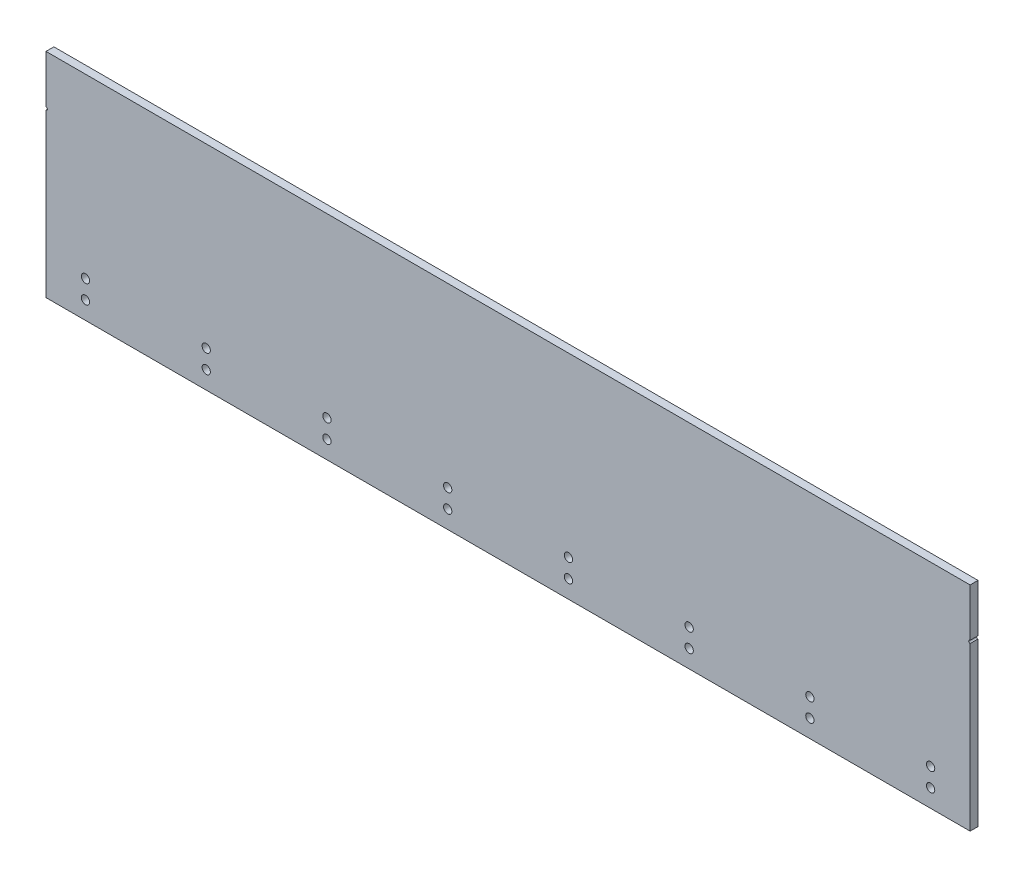
ISO-10303-21;
HEADER;
FILE_DESCRIPTION(('STEP AP214'),'2;1');
FILE_NAME('part.step','',(''),(''),'','','');
FILE_SCHEMA(('AUTOMOTIVE_DESIGN { 1 0 10303 214 1 1 1 1 }'));
ENDSEC;
DATA;
#1=APPLICATION_CONTEXT('core data for automotive mechanical design processes');
#2=APPLICATION_PROTOCOL_DEFINITION('international standard','automotive_design',2000,#1);
#3=PRODUCT_CONTEXT('',#1,'mechanical');
#4=PRODUCT('Part','Part','',(#3));
#5=PRODUCT_RELATED_PRODUCT_CATEGORY('part','',(#4));
#6=PRODUCT_DEFINITION_FORMATION('','',#4);
#7=PRODUCT_DEFINITION_CONTEXT('part definition',#1,'design');
#8=PRODUCT_DEFINITION('design','',#6,#7);
#9=PRODUCT_DEFINITION_SHAPE('','',#8);
#10=(LENGTH_UNIT() NAMED_UNIT(*) SI_UNIT(.MILLI.,.METRE.));
#11=(NAMED_UNIT(*) PLANE_ANGLE_UNIT() SI_UNIT($,.RADIAN.));
#12=(NAMED_UNIT(*) SI_UNIT($,.STERADIAN.) SOLID_ANGLE_UNIT());
#13=UNCERTAINTY_MEASURE_WITH_UNIT(LENGTH_MEASURE(1.E-05),#10,'distance_accuracy_value','');
#14=(GEOMETRIC_REPRESENTATION_CONTEXT(3) GLOBAL_UNCERTAINTY_ASSIGNED_CONTEXT((#13)) GLOBAL_UNIT_ASSIGNED_CONTEXT((#10,
#11,#12)) REPRESENTATION_CONTEXT('',''));
#15=CARTESIAN_POINT('',(0.,0.,0.));
#16=DIRECTION('',(0.,0.,1.));
#17=DIRECTION('',(1.,0.,0.));
#18=AXIS2_PLACEMENT_3D('',#15,#16,#17);
#19=CARTESIAN_POINT('',(0.,0.,-20.));
#20=DIRECTION('',(-1.,0.,0.));
#21=DIRECTION('',(0.,0.,1.));
#22=AXIS2_PLACEMENT_3D('',#19,#20,#21);
#23=PLANE('',#22);
#24=DIRECTION('',(0.,-1.,0.));
#25=VECTOR('',#24,1.);
#26=CARTESIAN_POINT('',(0.,0.,0.));
#27=LINE('',#26,#25);
#28=CARTESIAN_POINT('',(0.,411.5,0.));
#29=VERTEX_POINT('',#28);
#30=CARTESIAN_POINT('',(0.,0.,0.));
#31=VERTEX_POINT('',#30);
#32=EDGE_CURVE('E140',#29,#31,#27,.T.);
#33=ORIENTED_EDGE('',*,*,#32,.F.);
#34=DIRECTION('',(0.,0.,1.));
#35=VECTOR('',#34,1.);
#36=CARTESIAN_POINT('',(0.,411.5,-20.));
#37=LINE('',#36,#35);
#38=CARTESIAN_POINT('',(0.,411.5,-20.));
#39=VERTEX_POINT('',#38);
#40=EDGE_CURVE('E11',#39,#29,#37,.T.);
#41=ORIENTED_EDGE('',*,*,#40,.F.);
#42=DIRECTION('',(0.,-1.,0.));
#43=VECTOR('',#42,1.);
#44=CARTESIAN_POINT('',(0.,0.,-20.));
#45=LINE('',#44,#43);
#46=CARTESIAN_POINT('',(0.,0.,-20.));
#47=VERTEX_POINT('',#46);
#48=EDGE_CURVE('E161',#39,#47,#45,.T.);
#49=ORIENTED_EDGE('',*,*,#48,.T.);
#50=DIRECTION('',(0.,0.,1.));
#51=VECTOR('',#50,1.);
#52=CARTESIAN_POINT('',(0.,0.,-20.));
#53=LINE('',#52,#51);
#54=EDGE_CURVE('E46',#47,#31,#53,.T.);
#55=ORIENTED_EDGE('',*,*,#54,.T.);
#56=EDGE_LOOP('',(#33,#41,#49,#55));
#57=FACE_BOUND('',#56,.T.);
#58=ADVANCED_FACE('F43',(#57),#23,.T.);
#59=CARTESIAN_POINT('',(0.,415.,-20.));
#60=DIRECTION('',(0.,0.,1.));
#61=DIRECTION('',(1.,0.,0.));
#62=AXIS2_PLACEMENT_3D('',#59,#60,#61);
#63=CYLINDRICAL_SURFACE('',#62,3.5);
#64=CARTESIAN_POINT('',(0.,415.,0.));
#65=DIRECTION('',(0.,0.,-1.));
#66=DIRECTION('',(1.,0.,0.));
#67=AXIS2_PLACEMENT_3D('',#64,#65,#66);
#68=CIRCLE('',#67,3.5);
#69=CARTESIAN_POINT('',(0.,418.5,0.));
#70=VERTEX_POINT('',#69);
#71=EDGE_CURVE('E159',#70,#29,#68,.T.);
#72=ORIENTED_EDGE('',*,*,#71,.F.);
#73=DIRECTION('',(0.,0.,1.));
#74=VECTOR('',#73,1.);
#75=CARTESIAN_POINT('',(0.,418.5,-20.));
#76=LINE('',#75,#74);
#77=CARTESIAN_POINT('',(0.,418.5,-20.));
#78=VERTEX_POINT('',#77);
#79=EDGE_CURVE('E52',#78,#70,#76,.T.);
#80=ORIENTED_EDGE('',*,*,#79,.F.);
#81=CARTESIAN_POINT('',(0.,415.,-20.));
#82=DIRECTION('',(0.,0.,-1.));
#83=DIRECTION('',(1.,0.,0.));
#84=AXIS2_PLACEMENT_3D('',#81,#82,#83);
#85=CIRCLE('',#84,3.5);
#86=EDGE_CURVE('E130',#78,#39,#85,.T.);
#87=ORIENTED_EDGE('',*,*,#86,.T.);
#88=ORIENTED_EDGE('',*,*,#40,.T.);
#89=EDGE_LOOP('',(#72,#80,#87,#88));
#90=FACE_BOUND('',#89,.T.);
#91=ADVANCED_FACE('F173',(#90),#63,.F.);
#92=CARTESIAN_POINT('',(0.,418.5,-20.));
#93=DIRECTION('',(-1.,0.,0.));
#94=DIRECTION('',(0.,0.,1.));
#95=AXIS2_PLACEMENT_3D('',#92,#93,#94);
#96=PLANE('',#95);
#97=DIRECTION('',(0.,-1.,0.));
#98=VECTOR('',#97,1.);
#99=CARTESIAN_POINT('',(0.,418.5,0.));
#100=LINE('',#99,#98);
#101=CARTESIAN_POINT('',(0.,540.,0.));
#102=VERTEX_POINT('',#101);
#103=EDGE_CURVE('E117',#102,#70,#100,.T.);
#104=ORIENTED_EDGE('',*,*,#103,.F.);
#105=DIRECTION('',(0.,0.,1.));
#106=VECTOR('',#105,1.);
#107=CARTESIAN_POINT('',(0.,540.,-20.));
#108=LINE('',#107,#106);
#109=CARTESIAN_POINT('',(0.,540.,-20.));
#110=VERTEX_POINT('',#109);
#111=EDGE_CURVE('E112',#110,#102,#108,.T.);
#112=ORIENTED_EDGE('',*,*,#111,.F.);
#113=DIRECTION('',(0.,-1.,0.));
#114=VECTOR('',#113,1.);
#115=CARTESIAN_POINT('',(0.,418.5,-20.));
#116=LINE('',#115,#114);
#117=EDGE_CURVE('E115',#110,#78,#116,.T.);
#118=ORIENTED_EDGE('',*,*,#117,.T.);
#119=ORIENTED_EDGE('',*,*,#79,.T.);
#120=EDGE_LOOP('',(#104,#112,#118,#119));
#121=FACE_BOUND('',#120,.T.);
#122=ADVANCED_FACE('F114',(#121),#96,.T.);
#123=CARTESIAN_POINT('',(0.,540.,-20.));
#124=DIRECTION('',(0.,1.,0.));
#125=DIRECTION('',(0.,0.,1.));
#126=AXIS2_PLACEMENT_3D('',#123,#124,#125);
#127=PLANE('',#126);
#128=DIRECTION('',(-1.,0.,0.));
#129=VECTOR('',#128,1.);
#130=CARTESIAN_POINT('',(0.,540.,0.));
#131=LINE('',#130,#129);
#132=CARTESIAN_POINT('',(2340.,540.,0.));
#133=VERTEX_POINT('',#132);
#134=EDGE_CURVE('E156',#133,#102,#131,.T.);
#135=ORIENTED_EDGE('',*,*,#134,.F.);
#136=DIRECTION('',(0.,0.,1.));
#137=VECTOR('',#136,1.);
#138=CARTESIAN_POINT('',(2340.,540.,-20.));
#139=LINE('',#138,#137);
#140=CARTESIAN_POINT('',(2340.,540.,-20.));
#141=VERTEX_POINT('',#140);
#142=EDGE_CURVE('E122',#141,#133,#139,.T.);
#143=ORIENTED_EDGE('',*,*,#142,.F.);
#144=DIRECTION('',(-1.,0.,0.));
#145=VECTOR('',#144,1.);
#146=CARTESIAN_POINT('',(0.,540.,-20.));
#147=LINE('',#146,#145);
#148=EDGE_CURVE('E128',#141,#110,#147,.T.);
#149=ORIENTED_EDGE('',*,*,#148,.T.);
#150=ORIENTED_EDGE('',*,*,#111,.T.);
#151=EDGE_LOOP('',(#135,#143,#149,#150));
#152=FACE_BOUND('',#151,.T.);
#153=ADVANCED_FACE('F132',(#152),#127,.T.);
#154=CARTESIAN_POINT('',(2340.,418.5,-20.));
#155=DIRECTION('',(1.,0.,0.));
#156=DIRECTION('',(0.,0.,-1.));
#157=AXIS2_PLACEMENT_3D('',#154,#155,#156);
#158=PLANE('',#157);
#159=DIRECTION('',(0.,1.,0.));
#160=VECTOR('',#159,1.);
#161=CARTESIAN_POINT('',(2340.,418.5,0.));
#162=LINE('',#161,#160);
#163=CARTESIAN_POINT('',(2340.,418.5,0.));
#164=VERTEX_POINT('',#163);
#165=EDGE_CURVE('E153',#164,#133,#162,.T.);
#166=ORIENTED_EDGE('',*,*,#165,.F.);
#167=DIRECTION('',(0.,0.,1.));
#168=VECTOR('',#167,1.);
#169=CARTESIAN_POINT('',(2340.,418.5,-20.));
#170=LINE('',#169,#168);
#171=CARTESIAN_POINT('',(2340.,418.5,-20.));
#172=VERTEX_POINT('',#171);
#173=EDGE_CURVE('E165',#172,#164,#170,.T.);
#174=ORIENTED_EDGE('',*,*,#173,.F.);
#175=DIRECTION('',(0.,1.,0.));
#176=VECTOR('',#175,1.);
#177=CARTESIAN_POINT('',(2340.,418.5,-20.));
#178=LINE('',#177,#176);
#179=EDGE_CURVE('E133',#172,#141,#178,.T.);
#180=ORIENTED_EDGE('',*,*,#179,.T.);
#181=ORIENTED_EDGE('',*,*,#142,.T.);
#182=EDGE_LOOP('',(#166,#174,#180,#181));
#183=FACE_BOUND('',#182,.T.);
#184=ADVANCED_FACE('F186',(#183),#158,.T.);
#185=CARTESIAN_POINT('',(2340.,415.,-20.));
#186=DIRECTION('',(0.,0.,1.));
#187=DIRECTION('',(1.,0.,0.));
#188=AXIS2_PLACEMENT_3D('',#185,#186,#187);
#189=CYLINDRICAL_SURFACE('',#188,3.5);
#190=CARTESIAN_POINT('',(2340.,415.,0.));
#191=DIRECTION('',(0.,0.,-1.));
#192=DIRECTION('',(1.,0.,0.));
#193=AXIS2_PLACEMENT_3D('',#190,#191,#192);
#194=CIRCLE('',#193,3.5);
#195=CARTESIAN_POINT('',(2340.,411.5,0.));
#196=VERTEX_POINT('',#195);
#197=EDGE_CURVE('E150',#196,#164,#194,.T.);
#198=ORIENTED_EDGE('',*,*,#197,.F.);
#199=DIRECTION('',(0.,0.,1.));
#200=VECTOR('',#199,1.);
#201=CARTESIAN_POINT('',(2340.,411.5,-20.));
#202=LINE('',#201,#200);
#203=CARTESIAN_POINT('',(2340.,411.5,-20.));
#204=VERTEX_POINT('',#203);
#205=EDGE_CURVE('E167',#204,#196,#202,.T.);
#206=ORIENTED_EDGE('',*,*,#205,.F.);
#207=CARTESIAN_POINT('',(2340.,415.,-20.));
#208=DIRECTION('',(0.,0.,-1.));
#209=DIRECTION('',(1.,0.,0.));
#210=AXIS2_PLACEMENT_3D('',#207,#208,#209);
#211=CIRCLE('',#210,3.5);
#212=EDGE_CURVE('E135',#204,#172,#211,.T.);
#213=ORIENTED_EDGE('',*,*,#212,.T.);
#214=ORIENTED_EDGE('',*,*,#173,.T.);
#215=EDGE_LOOP('',(#198,#206,#213,#214));
#216=FACE_BOUND('',#215,.T.);
#217=ADVANCED_FACE('F189',(#216),#189,.F.);
#218=CARTESIAN_POINT('',(2340.,0.,-20.));
#219=DIRECTION('',(1.,0.,0.));
#220=DIRECTION('',(0.,0.,-1.));
#221=AXIS2_PLACEMENT_3D('',#218,#219,#220);
#222=PLANE('',#221);
#223=DIRECTION('',(0.,1.,0.));
#224=VECTOR('',#223,1.);
#225=CARTESIAN_POINT('',(2340.,0.,0.));
#226=LINE('',#225,#224);
#227=CARTESIAN_POINT('',(2340.,0.,0.));
#228=VERTEX_POINT('',#227);
#229=EDGE_CURVE('E147',#228,#196,#226,.T.);
#230=ORIENTED_EDGE('',*,*,#229,.F.);
#231=DIRECTION('',(0.,0.,1.));
#232=VECTOR('',#231,1.);
#233=CARTESIAN_POINT('',(2340.,0.,-20.));
#234=LINE('',#233,#232);
#235=CARTESIAN_POINT('',(2340.,0.,-20.));
#236=VERTEX_POINT('',#235);
#237=EDGE_CURVE('E168',#236,#228,#234,.T.);
#238=ORIENTED_EDGE('',*,*,#237,.F.);
#239=DIRECTION('',(0.,1.,0.));
#240=VECTOR('',#239,1.);
#241=CARTESIAN_POINT('',(2340.,0.,-20.));
#242=LINE('',#241,#240);
#243=EDGE_CURVE('E375',#236,#204,#242,.T.);
#244=ORIENTED_EDGE('',*,*,#243,.T.);
#245=ORIENTED_EDGE('',*,*,#205,.T.);
#246=EDGE_LOOP('',(#230,#238,#244,#245));
#247=FACE_BOUND('',#246,.T.);
#248=ADVANCED_FACE('F193',(#247),#222,.T.);
#249=CARTESIAN_POINT('',(0.,0.,-20.));
#250=DIRECTION('',(0.,-1.,0.));
#251=DIRECTION('',(0.,0.,-1.));
#252=AXIS2_PLACEMENT_3D('',#249,#250,#251);
#253=PLANE('',#252);
#254=DIRECTION('',(1.,0.,0.));
#255=VECTOR('',#254,1.);
#256=CARTESIAN_POINT('',(0.,0.,0.));
#257=LINE('',#256,#255);
#258=EDGE_CURVE('E143',#31,#228,#257,.T.);
#259=ORIENTED_EDGE('',*,*,#258,.F.);
#260=ORIENTED_EDGE('',*,*,#54,.F.);
#261=DIRECTION('',(1.,0.,0.));
#262=VECTOR('',#261,1.);
#263=CARTESIAN_POINT('',(0.,0.,-20.));
#264=LINE('',#263,#262);
#265=EDGE_CURVE('E373',#47,#236,#264,.T.);
#266=ORIENTED_EDGE('',*,*,#265,.T.);
#267=ORIENTED_EDGE('',*,*,#237,.T.);
#268=EDGE_LOOP('',(#259,#260,#266,#267));
#269=FACE_BOUND('',#268,.T.);
#270=ADVANCED_FACE('F170',(#269),#253,.T.);
#271=CARTESIAN_POINT('',(0.,415.,-20.));
#272=DIRECTION('',(0.,0.,1.));
#273=DIRECTION('',(1.,0.,0.));
#274=AXIS2_PLACEMENT_3D('',#271,#272,#273);
#275=PLANE('',#274);
#276=CARTESIAN_POINT('',(2240.,45.,-20.));
#277=DIRECTION('',(0.,0.,1.));
#278=DIRECTION('',(1.,0.,0.));
#279=AXIS2_PLACEMENT_3D('',#276,#277,#278);
#280=CIRCLE('',#279,10.5000000000001);
#281=CARTESIAN_POINT('',(2250.5,45.,-20.));
#282=VERTEX_POINT('',#281);
#283=EDGE_CURVE('E276',#282,#282,#280,.T.);
#284=ORIENTED_EDGE('',*,*,#283,.T.);
#285=EDGE_LOOP('',(#284));
#286=FACE_BOUND('',#285,.T.);
#287=CARTESIAN_POINT('',(2240.,92.,-20.));
#288=DIRECTION('',(0.,0.,1.));
#289=DIRECTION('',(1.,0.,0.));
#290=AXIS2_PLACEMENT_3D('',#287,#288,#289);
#291=CIRCLE('',#290,10.5000000000001);
#292=CARTESIAN_POINT('',(2250.5,92.,-20.));
#293=VERTEX_POINT('',#292);
#294=EDGE_CURVE('E284',#293,#293,#291,.T.);
#295=ORIENTED_EDGE('',*,*,#294,.T.);
#296=EDGE_LOOP('',(#295));
#297=FACE_BOUND('',#296,.T.);
#298=CARTESIAN_POINT('',(1934.28571428571,45.,-20.));
#299=DIRECTION('',(0.,0.,1.));
#300=DIRECTION('',(1.,0.,0.));
#301=AXIS2_PLACEMENT_3D('',#298,#299,#300);
#302=CIRCLE('',#301,10.4999999999999);
#303=CARTESIAN_POINT('',(1944.78571428571,45.,-20.));
#304=VERTEX_POINT('',#303);
#305=EDGE_CURVE('E290',#304,#304,#302,.T.);
#306=ORIENTED_EDGE('',*,*,#305,.T.);
#307=EDGE_LOOP('',(#306));
#308=FACE_BOUND('',#307,.T.);
#309=CARTESIAN_POINT('',(1934.28571428571,92.,-20.));
#310=DIRECTION('',(0.,0.,1.));
#311=DIRECTION('',(1.,0.,0.));
#312=AXIS2_PLACEMENT_3D('',#309,#310,#311);
#313=CIRCLE('',#312,10.4999999999999);
#314=CARTESIAN_POINT('',(1944.78571428571,92.,-20.));
#315=VERTEX_POINT('',#314);
#316=EDGE_CURVE('E296',#315,#315,#313,.T.);
#317=ORIENTED_EDGE('',*,*,#316,.T.);
#318=EDGE_LOOP('',(#317));
#319=FACE_BOUND('',#318,.T.);
#320=CARTESIAN_POINT('',(1628.57142857143,45.,-20.));
#321=DIRECTION('',(0.,0.,1.));
#322=DIRECTION('',(1.,0.,0.));
#323=AXIS2_PLACEMENT_3D('',#320,#321,#322);
#324=CIRCLE('',#323,10.4999999999999);
#325=CARTESIAN_POINT('',(1639.07142857143,45.,-20.));
#326=VERTEX_POINT('',#325);
#327=EDGE_CURVE('E302',#326,#326,#324,.T.);
#328=ORIENTED_EDGE('',*,*,#327,.T.);
#329=EDGE_LOOP('',(#328));
#330=FACE_BOUND('',#329,.T.);
#331=CARTESIAN_POINT('',(1628.57142857143,92.,-20.));
#332=DIRECTION('',(0.,0.,1.));
#333=DIRECTION('',(1.,0.,0.));
#334=AXIS2_PLACEMENT_3D('',#331,#332,#333);
#335=CIRCLE('',#334,10.4999999999999);
#336=CARTESIAN_POINT('',(1639.07142857143,92.,-20.));
#337=VERTEX_POINT('',#336);
#338=EDGE_CURVE('E308',#337,#337,#335,.T.);
#339=ORIENTED_EDGE('',*,*,#338,.T.);
#340=EDGE_LOOP('',(#339));
#341=FACE_BOUND('',#340,.T.);
#342=CARTESIAN_POINT('',(1322.85714285714,45.,-20.));
#343=DIRECTION('',(0.,0.,1.));
#344=DIRECTION('',(1.,0.,0.));
#345=AXIS2_PLACEMENT_3D('',#342,#343,#344);
#346=CIRCLE('',#345,10.4999999999999);
#347=CARTESIAN_POINT('',(1333.35714285714,45.,-20.));
#348=VERTEX_POINT('',#347);
#349=EDGE_CURVE('E314',#348,#348,#346,.T.);
#350=ORIENTED_EDGE('',*,*,#349,.T.);
#351=EDGE_LOOP('',(#350));
#352=FACE_BOUND('',#351,.T.);
#353=CARTESIAN_POINT('',(1322.85714285714,92.,-20.));
#354=DIRECTION('',(0.,0.,1.));
#355=DIRECTION('',(1.,0.,0.));
#356=AXIS2_PLACEMENT_3D('',#353,#354,#355);
#357=CIRCLE('',#356,10.4999999999999);
#358=CARTESIAN_POINT('',(1333.35714285714,92.,-20.));
#359=VERTEX_POINT('',#358);
#360=EDGE_CURVE('E320',#359,#359,#357,.T.);
#361=ORIENTED_EDGE('',*,*,#360,.T.);
#362=EDGE_LOOP('',(#361));
#363=FACE_BOUND('',#362,.T.);
#364=CARTESIAN_POINT('',(1017.14285714286,45.,-20.));
#365=DIRECTION('',(0.,0.,1.));
#366=DIRECTION('',(1.,0.,0.));
#367=AXIS2_PLACEMENT_3D('',#364,#365,#366);
#368=CIRCLE('',#367,10.4999999999999);
#369=CARTESIAN_POINT('',(1027.64285714286,45.,-20.));
#370=VERTEX_POINT('',#369);
#371=EDGE_CURVE('E326',#370,#370,#368,.T.);
#372=ORIENTED_EDGE('',*,*,#371,.T.);
#373=EDGE_LOOP('',(#372));
#374=FACE_BOUND('',#373,.T.);
#375=CARTESIAN_POINT('',(1017.14285714286,92.,-20.));
#376=DIRECTION('',(0.,0.,1.));
#377=DIRECTION('',(1.,0.,0.));
#378=AXIS2_PLACEMENT_3D('',#375,#376,#377);
#379=CIRCLE('',#378,10.4999999999999);
#380=CARTESIAN_POINT('',(1027.64285714286,92.,-20.));
#381=VERTEX_POINT('',#380);
#382=EDGE_CURVE('E332',#381,#381,#379,.T.);
#383=ORIENTED_EDGE('',*,*,#382,.T.);
#384=EDGE_LOOP('',(#383));
#385=FACE_BOUND('',#384,.T.);
#386=CARTESIAN_POINT('',(711.428571428571,45.,-20.));
#387=DIRECTION('',(0.,0.,1.));
#388=DIRECTION('',(1.,0.,0.));
#389=AXIS2_PLACEMENT_3D('',#386,#387,#388);
#390=CIRCLE('',#389,10.5);
#391=CARTESIAN_POINT('',(721.928571428571,45.,-20.));
#392=VERTEX_POINT('',#391);
#393=EDGE_CURVE('E338',#392,#392,#390,.T.);
#394=ORIENTED_EDGE('',*,*,#393,.T.);
#395=EDGE_LOOP('',(#394));
#396=FACE_BOUND('',#395,.T.);
#397=CARTESIAN_POINT('',(711.428571428571,92.,-20.));
#398=DIRECTION('',(0.,0.,1.));
#399=DIRECTION('',(1.,0.,0.));
#400=AXIS2_PLACEMENT_3D('',#397,#398,#399);
#401=CIRCLE('',#400,10.5);
#402=CARTESIAN_POINT('',(721.928571428571,92.,-20.));
#403=VERTEX_POINT('',#402);
#404=EDGE_CURVE('E344',#403,#403,#401,.T.);
#405=ORIENTED_EDGE('',*,*,#404,.T.);
#406=EDGE_LOOP('',(#405));
#407=FACE_BOUND('',#406,.T.);
#408=CARTESIAN_POINT('',(405.714285714286,45.,-20.));
#409=DIRECTION('',(0.,0.,1.));
#410=DIRECTION('',(1.,0.,0.));
#411=AXIS2_PLACEMENT_3D('',#408,#409,#410);
#412=CIRCLE('',#411,10.5);
#413=CARTESIAN_POINT('',(416.214285714286,45.,-20.));
#414=VERTEX_POINT('',#413);
#415=EDGE_CURVE('E350',#414,#414,#412,.T.);
#416=ORIENTED_EDGE('',*,*,#415,.T.);
#417=EDGE_LOOP('',(#416));
#418=FACE_BOUND('',#417,.T.);
#419=CARTESIAN_POINT('',(405.714285714286,92.,-20.));
#420=DIRECTION('',(0.,0.,1.));
#421=DIRECTION('',(1.,0.,0.));
#422=AXIS2_PLACEMENT_3D('',#419,#420,#421);
#423=CIRCLE('',#422,10.5);
#424=CARTESIAN_POINT('',(416.214285714286,92.,-20.));
#425=VERTEX_POINT('',#424);
#426=EDGE_CURVE('E356',#425,#425,#423,.T.);
#427=ORIENTED_EDGE('',*,*,#426,.T.);
#428=EDGE_LOOP('',(#427));
#429=FACE_BOUND('',#428,.T.);
#430=CARTESIAN_POINT('',(100.,45.,-20.));
#431=DIRECTION('',(0.,0.,1.));
#432=DIRECTION('',(1.,0.,0.));
#433=AXIS2_PLACEMENT_3D('',#430,#431,#432);
#434=CIRCLE('',#433,10.5);
#435=CARTESIAN_POINT('',(110.5,45.,-20.));
#436=VERTEX_POINT('',#435);
#437=EDGE_CURVE('E362',#436,#436,#434,.T.);
#438=ORIENTED_EDGE('',*,*,#437,.T.);
#439=EDGE_LOOP('',(#438));
#440=FACE_BOUND('',#439,.T.);
#441=CARTESIAN_POINT('',(100.,92.,-20.));
#442=DIRECTION('',(0.,0.,1.));
#443=DIRECTION('',(1.,0.,0.));
#444=AXIS2_PLACEMENT_3D('',#441,#442,#443);
#445=CIRCLE('',#444,10.5);
#446=CARTESIAN_POINT('',(110.5,92.,-20.));
#447=VERTEX_POINT('',#446);
#448=EDGE_CURVE('E144',#447,#447,#445,.T.);
#449=ORIENTED_EDGE('',*,*,#448,.T.);
#450=EDGE_LOOP('',(#449));
#451=FACE_BOUND('',#450,.T.);
#452=ORIENTED_EDGE('',*,*,#48,.F.);
#453=ORIENTED_EDGE('',*,*,#86,.F.);
#454=ORIENTED_EDGE('',*,*,#117,.F.);
#455=ORIENTED_EDGE('',*,*,#148,.F.);
#456=ORIENTED_EDGE('',*,*,#179,.F.);
#457=ORIENTED_EDGE('',*,*,#212,.F.);
#458=ORIENTED_EDGE('',*,*,#243,.F.);
#459=ORIENTED_EDGE('',*,*,#265,.F.);
#460=EDGE_LOOP('',(#452,#453,#454,#455,#456,#457,#458,#459));
#461=FACE_BOUND('',#460,.T.);
#462=ADVANCED_FACE('F126',(#286,#297,#308,#319,#330,#341,#352,#363,#374,#385,#396,#407,#418,
#429,#440,#451,#461),#275,.F.);
#463=CARTESIAN_POINT('',(0.,415.,0.));
#464=DIRECTION('',(0.,0.,1.));
#465=DIRECTION('',(1.,0.,0.));
#466=AXIS2_PLACEMENT_3D('',#463,#464,#465);
#467=PLANE('',#466);
#468=CARTESIAN_POINT('',(2240.,45.,0.));
#469=DIRECTION('',(0.,0.,1.));
#470=DIRECTION('',(1.,0.,0.));
#471=AXIS2_PLACEMENT_3D('',#468,#469,#470);
#472=CIRCLE('',#471,10.5000000000001);
#473=CARTESIAN_POINT('',(2250.5,45.,0.));
#474=VERTEX_POINT('',#473);
#475=EDGE_CURVE('E279',#474,#474,#472,.T.);
#476=ORIENTED_EDGE('',*,*,#475,.F.);
#477=EDGE_LOOP('',(#476));
#478=FACE_BOUND('',#477,.T.);
#479=CARTESIAN_POINT('',(2240.,92.,0.));
#480=DIRECTION('',(0.,0.,1.));
#481=DIRECTION('',(1.,0.,0.));
#482=AXIS2_PLACEMENT_3D('',#479,#480,#481);
#483=CIRCLE('',#482,10.5000000000001);
#484=CARTESIAN_POINT('',(2250.5,92.,0.));
#485=VERTEX_POINT('',#484);
#486=EDGE_CURVE('E281',#485,#485,#483,.T.);
#487=ORIENTED_EDGE('',*,*,#486,.F.);
#488=EDGE_LOOP('',(#487));
#489=FACE_BOUND('',#488,.T.);
#490=CARTESIAN_POINT('',(1934.28571428571,45.,0.));
#491=DIRECTION('',(0.,0.,1.));
#492=DIRECTION('',(1.,0.,0.));
#493=AXIS2_PLACEMENT_3D('',#490,#491,#492);
#494=CIRCLE('',#493,10.4999999999999);
#495=CARTESIAN_POINT('',(1944.78571428571,45.,0.));
#496=VERTEX_POINT('',#495);
#497=EDGE_CURVE('E287',#496,#496,#494,.T.);
#498=ORIENTED_EDGE('',*,*,#497,.F.);
#499=EDGE_LOOP('',(#498));
#500=FACE_BOUND('',#499,.T.);
#501=CARTESIAN_POINT('',(1934.28571428571,92.,0.));
#502=DIRECTION('',(0.,0.,1.));
#503=DIRECTION('',(1.,0.,0.));
#504=AXIS2_PLACEMENT_3D('',#501,#502,#503);
#505=CIRCLE('',#504,10.4999999999999);
#506=CARTESIAN_POINT('',(1944.78571428571,92.,0.));
#507=VERTEX_POINT('',#506);
#508=EDGE_CURVE('E293',#507,#507,#505,.T.);
#509=ORIENTED_EDGE('',*,*,#508,.F.);
#510=EDGE_LOOP('',(#509));
#511=FACE_BOUND('',#510,.T.);
#512=CARTESIAN_POINT('',(1628.57142857143,45.,0.));
#513=DIRECTION('',(0.,0.,1.));
#514=DIRECTION('',(1.,0.,0.));
#515=AXIS2_PLACEMENT_3D('',#512,#513,#514);
#516=CIRCLE('',#515,10.4999999999999);
#517=CARTESIAN_POINT('',(1639.07142857143,45.,0.));
#518=VERTEX_POINT('',#517);
#519=EDGE_CURVE('E299',#518,#518,#516,.T.);
#520=ORIENTED_EDGE('',*,*,#519,.F.);
#521=EDGE_LOOP('',(#520));
#522=FACE_BOUND('',#521,.T.);
#523=CARTESIAN_POINT('',(1628.57142857143,92.,0.));
#524=DIRECTION('',(0.,0.,1.));
#525=DIRECTION('',(1.,0.,0.));
#526=AXIS2_PLACEMENT_3D('',#523,#524,#525);
#527=CIRCLE('',#526,10.4999999999999);
#528=CARTESIAN_POINT('',(1639.07142857143,92.,0.));
#529=VERTEX_POINT('',#528);
#530=EDGE_CURVE('E305',#529,#529,#527,.T.);
#531=ORIENTED_EDGE('',*,*,#530,.F.);
#532=EDGE_LOOP('',(#531));
#533=FACE_BOUND('',#532,.T.);
#534=CARTESIAN_POINT('',(1322.85714285714,45.,0.));
#535=DIRECTION('',(0.,0.,1.));
#536=DIRECTION('',(1.,0.,0.));
#537=AXIS2_PLACEMENT_3D('',#534,#535,#536);
#538=CIRCLE('',#537,10.4999999999999);
#539=CARTESIAN_POINT('',(1333.35714285714,45.,0.));
#540=VERTEX_POINT('',#539);
#541=EDGE_CURVE('E311',#540,#540,#538,.T.);
#542=ORIENTED_EDGE('',*,*,#541,.F.);
#543=EDGE_LOOP('',(#542));
#544=FACE_BOUND('',#543,.T.);
#545=CARTESIAN_POINT('',(1322.85714285714,92.,0.));
#546=DIRECTION('',(0.,0.,1.));
#547=DIRECTION('',(1.,0.,0.));
#548=AXIS2_PLACEMENT_3D('',#545,#546,#547);
#549=CIRCLE('',#548,10.4999999999999);
#550=CARTESIAN_POINT('',(1333.35714285714,92.,0.));
#551=VERTEX_POINT('',#550);
#552=EDGE_CURVE('E317',#551,#551,#549,.T.);
#553=ORIENTED_EDGE('',*,*,#552,.F.);
#554=EDGE_LOOP('',(#553));
#555=FACE_BOUND('',#554,.T.);
#556=CARTESIAN_POINT('',(1017.14285714286,45.,0.));
#557=DIRECTION('',(0.,0.,1.));
#558=DIRECTION('',(1.,0.,0.));
#559=AXIS2_PLACEMENT_3D('',#556,#557,#558);
#560=CIRCLE('',#559,10.4999999999999);
#561=CARTESIAN_POINT('',(1027.64285714286,45.,0.));
#562=VERTEX_POINT('',#561);
#563=EDGE_CURVE('E323',#562,#562,#560,.T.);
#564=ORIENTED_EDGE('',*,*,#563,.F.);
#565=EDGE_LOOP('',(#564));
#566=FACE_BOUND('',#565,.T.);
#567=CARTESIAN_POINT('',(1017.14285714286,92.,0.));
#568=DIRECTION('',(0.,0.,1.));
#569=DIRECTION('',(1.,0.,0.));
#570=AXIS2_PLACEMENT_3D('',#567,#568,#569);
#571=CIRCLE('',#570,10.4999999999999);
#572=CARTESIAN_POINT('',(1027.64285714286,92.,0.));
#573=VERTEX_POINT('',#572);
#574=EDGE_CURVE('E329',#573,#573,#571,.T.);
#575=ORIENTED_EDGE('',*,*,#574,.F.);
#576=EDGE_LOOP('',(#575));
#577=FACE_BOUND('',#576,.T.);
#578=CARTESIAN_POINT('',(711.428571428571,45.,0.));
#579=DIRECTION('',(0.,0.,1.));
#580=DIRECTION('',(1.,0.,0.));
#581=AXIS2_PLACEMENT_3D('',#578,#579,#580);
#582=CIRCLE('',#581,10.5);
#583=CARTESIAN_POINT('',(721.928571428571,45.,0.));
#584=VERTEX_POINT('',#583);
#585=EDGE_CURVE('E335',#584,#584,#582,.T.);
#586=ORIENTED_EDGE('',*,*,#585,.F.);
#587=EDGE_LOOP('',(#586));
#588=FACE_BOUND('',#587,.T.);
#589=CARTESIAN_POINT('',(711.428571428571,92.,0.));
#590=DIRECTION('',(0.,0.,1.));
#591=DIRECTION('',(1.,0.,0.));
#592=AXIS2_PLACEMENT_3D('',#589,#590,#591);
#593=CIRCLE('',#592,10.5);
#594=CARTESIAN_POINT('',(721.928571428571,92.,0.));
#595=VERTEX_POINT('',#594);
#596=EDGE_CURVE('E341',#595,#595,#593,.T.);
#597=ORIENTED_EDGE('',*,*,#596,.F.);
#598=EDGE_LOOP('',(#597));
#599=FACE_BOUND('',#598,.T.);
#600=CARTESIAN_POINT('',(405.714285714286,45.,0.));
#601=DIRECTION('',(0.,0.,1.));
#602=DIRECTION('',(1.,0.,0.));
#603=AXIS2_PLACEMENT_3D('',#600,#601,#602);
#604=CIRCLE('',#603,10.5);
#605=CARTESIAN_POINT('',(416.214285714286,45.,0.));
#606=VERTEX_POINT('',#605);
#607=EDGE_CURVE('E347',#606,#606,#604,.T.);
#608=ORIENTED_EDGE('',*,*,#607,.F.);
#609=EDGE_LOOP('',(#608));
#610=FACE_BOUND('',#609,.T.);
#611=CARTESIAN_POINT('',(405.714285714286,92.,0.));
#612=DIRECTION('',(0.,0.,1.));
#613=DIRECTION('',(1.,0.,0.));
#614=AXIS2_PLACEMENT_3D('',#611,#612,#613);
#615=CIRCLE('',#614,10.5);
#616=CARTESIAN_POINT('',(416.214285714286,92.,0.));
#617=VERTEX_POINT('',#616);
#618=EDGE_CURVE('E353',#617,#617,#615,.T.);
#619=ORIENTED_EDGE('',*,*,#618,.F.);
#620=EDGE_LOOP('',(#619));
#621=FACE_BOUND('',#620,.T.);
#622=CARTESIAN_POINT('',(100.,45.,0.));
#623=DIRECTION('',(0.,0.,1.));
#624=DIRECTION('',(1.,0.,0.));
#625=AXIS2_PLACEMENT_3D('',#622,#623,#624);
#626=CIRCLE('',#625,10.5);
#627=CARTESIAN_POINT('',(110.5,45.,0.));
#628=VERTEX_POINT('',#627);
#629=EDGE_CURVE('E359',#628,#628,#626,.T.);
#630=ORIENTED_EDGE('',*,*,#629,.F.);
#631=EDGE_LOOP('',(#630));
#632=FACE_BOUND('',#631,.T.);
#633=CARTESIAN_POINT('',(100.,92.,0.));
#634=DIRECTION('',(0.,0.,1.));
#635=DIRECTION('',(1.,0.,0.));
#636=AXIS2_PLACEMENT_3D('',#633,#634,#635);
#637=CIRCLE('',#636,10.5);
#638=CARTESIAN_POINT('',(110.5,92.,0.));
#639=VERTEX_POINT('',#638);
#640=EDGE_CURVE('E365',#639,#639,#637,.T.);
#641=ORIENTED_EDGE('',*,*,#640,.F.);
#642=EDGE_LOOP('',(#641));
#643=FACE_BOUND('',#642,.T.);
#644=ORIENTED_EDGE('',*,*,#32,.T.);
#645=ORIENTED_EDGE('',*,*,#258,.T.);
#646=ORIENTED_EDGE('',*,*,#229,.T.);
#647=ORIENTED_EDGE('',*,*,#197,.T.);
#648=ORIENTED_EDGE('',*,*,#165,.T.);
#649=ORIENTED_EDGE('',*,*,#134,.T.);
#650=ORIENTED_EDGE('',*,*,#103,.T.);
#651=ORIENTED_EDGE('',*,*,#71,.T.);
#652=EDGE_LOOP('',(#644,#645,#646,#647,#648,#649,#650,#651));
#653=FACE_BOUND('',#652,.T.);
#654=ADVANCED_FACE('F172',(#478,#489,#500,#511,#522,#533,#544,#555,#566,#577,#588,#599,#610,
#621,#632,#643,#653),#467,.T.);
#655=CARTESIAN_POINT('',(100.,92.,-20.));
#656=DIRECTION('',(0.,0.,1.));
#657=DIRECTION('',(1.,0.,0.));
#658=AXIS2_PLACEMENT_3D('',#655,#656,#657);
#659=CYLINDRICAL_SURFACE('',#658,10.5);
#660=ORIENTED_EDGE('',*,*,#448,.F.);
#661=EDGE_LOOP('',(#660));
#662=FACE_BOUND('',#661,.T.);
#663=ORIENTED_EDGE('',*,*,#640,.T.);
#664=EDGE_LOOP('',(#663));
#665=FACE_BOUND('',#664,.T.);
#666=ADVANCED_FACE('F205',(#662,#665),#659,.F.);
#667=CARTESIAN_POINT('',(100.,45.,-20.));
#668=DIRECTION('',(0.,0.,1.));
#669=DIRECTION('',(1.,0.,0.));
#670=AXIS2_PLACEMENT_3D('',#667,#668,#669);
#671=CYLINDRICAL_SURFACE('',#670,10.5);
#672=ORIENTED_EDGE('',*,*,#437,.F.);
#673=EDGE_LOOP('',(#672));
#674=FACE_BOUND('',#673,.T.);
#675=ORIENTED_EDGE('',*,*,#629,.T.);
#676=EDGE_LOOP('',(#675));
#677=FACE_BOUND('',#676,.T.);
#678=ADVANCED_FACE('F212',(#674,#677),#671,.F.);
#679=CARTESIAN_POINT('',(405.714285714286,92.,-20.));
#680=DIRECTION('',(0.,0.,1.));
#681=DIRECTION('',(1.,0.,0.));
#682=AXIS2_PLACEMENT_3D('',#679,#680,#681);
#683=CYLINDRICAL_SURFACE('',#682,10.5);
#684=ORIENTED_EDGE('',*,*,#426,.F.);
#685=EDGE_LOOP('',(#684));
#686=FACE_BOUND('',#685,.T.);
#687=ORIENTED_EDGE('',*,*,#618,.T.);
#688=EDGE_LOOP('',(#687));
#689=FACE_BOUND('',#688,.T.);
#690=ADVANCED_FACE('F216',(#686,#689),#683,.F.);
#691=CARTESIAN_POINT('',(405.714285714286,45.,-20.));
#692=DIRECTION('',(0.,0.,1.));
#693=DIRECTION('',(1.,0.,0.));
#694=AXIS2_PLACEMENT_3D('',#691,#692,#693);
#695=CYLINDRICAL_SURFACE('',#694,10.5);
#696=ORIENTED_EDGE('',*,*,#415,.F.);
#697=EDGE_LOOP('',(#696));
#698=FACE_BOUND('',#697,.T.);
#699=ORIENTED_EDGE('',*,*,#607,.T.);
#700=EDGE_LOOP('',(#699));
#701=FACE_BOUND('',#700,.T.);
#702=ADVANCED_FACE('F220',(#698,#701),#695,.F.);
#703=CARTESIAN_POINT('',(711.428571428571,92.,-20.));
#704=DIRECTION('',(0.,0.,1.));
#705=DIRECTION('',(1.,0.,0.));
#706=AXIS2_PLACEMENT_3D('',#703,#704,#705);
#707=CYLINDRICAL_SURFACE('',#706,10.5);
#708=ORIENTED_EDGE('',*,*,#404,.F.);
#709=EDGE_LOOP('',(#708));
#710=FACE_BOUND('',#709,.T.);
#711=ORIENTED_EDGE('',*,*,#596,.T.);
#712=EDGE_LOOP('',(#711));
#713=FACE_BOUND('',#712,.T.);
#714=ADVANCED_FACE('F224',(#710,#713),#707,.F.);
#715=CARTESIAN_POINT('',(711.428571428571,45.,-20.));
#716=DIRECTION('',(0.,0.,1.));
#717=DIRECTION('',(1.,0.,0.));
#718=AXIS2_PLACEMENT_3D('',#715,#716,#717);
#719=CYLINDRICAL_SURFACE('',#718,10.5);
#720=ORIENTED_EDGE('',*,*,#393,.F.);
#721=EDGE_LOOP('',(#720));
#722=FACE_BOUND('',#721,.T.);
#723=ORIENTED_EDGE('',*,*,#585,.T.);
#724=EDGE_LOOP('',(#723));
#725=FACE_BOUND('',#724,.T.);
#726=ADVANCED_FACE('F228',(#722,#725),#719,.F.);
#727=CARTESIAN_POINT('',(1017.14285714286,92.,-20.));
#728=DIRECTION('',(0.,0.,1.));
#729=DIRECTION('',(1.,0.,0.));
#730=AXIS2_PLACEMENT_3D('',#727,#728,#729);
#731=CYLINDRICAL_SURFACE('',#730,10.4999999999999);
#732=ORIENTED_EDGE('',*,*,#382,.F.);
#733=EDGE_LOOP('',(#732));
#734=FACE_BOUND('',#733,.T.);
#735=ORIENTED_EDGE('',*,*,#574,.T.);
#736=EDGE_LOOP('',(#735));
#737=FACE_BOUND('',#736,.T.);
#738=ADVANCED_FACE('F232',(#734,#737),#731,.F.);
#739=CARTESIAN_POINT('',(1017.14285714286,45.,-20.));
#740=DIRECTION('',(0.,0.,1.));
#741=DIRECTION('',(1.,0.,0.));
#742=AXIS2_PLACEMENT_3D('',#739,#740,#741);
#743=CYLINDRICAL_SURFACE('',#742,10.4999999999999);
#744=ORIENTED_EDGE('',*,*,#371,.F.);
#745=EDGE_LOOP('',(#744));
#746=FACE_BOUND('',#745,.T.);
#747=ORIENTED_EDGE('',*,*,#563,.T.);
#748=EDGE_LOOP('',(#747));
#749=FACE_BOUND('',#748,.T.);
#750=ADVANCED_FACE('F236',(#746,#749),#743,.F.);
#751=CARTESIAN_POINT('',(1322.85714285714,92.,-20.));
#752=DIRECTION('',(0.,0.,1.));
#753=DIRECTION('',(1.,0.,0.));
#754=AXIS2_PLACEMENT_3D('',#751,#752,#753);
#755=CYLINDRICAL_SURFACE('',#754,10.4999999999999);
#756=ORIENTED_EDGE('',*,*,#360,.F.);
#757=EDGE_LOOP('',(#756));
#758=FACE_BOUND('',#757,.T.);
#759=ORIENTED_EDGE('',*,*,#552,.T.);
#760=EDGE_LOOP('',(#759));
#761=FACE_BOUND('',#760,.T.);
#762=ADVANCED_FACE('F240',(#758,#761),#755,.F.);
#763=CARTESIAN_POINT('',(1322.85714285714,45.,-20.));
#764=DIRECTION('',(0.,0.,1.));
#765=DIRECTION('',(1.,0.,0.));
#766=AXIS2_PLACEMENT_3D('',#763,#764,#765);
#767=CYLINDRICAL_SURFACE('',#766,10.4999999999999);
#768=ORIENTED_EDGE('',*,*,#349,.F.);
#769=EDGE_LOOP('',(#768));
#770=FACE_BOUND('',#769,.T.);
#771=ORIENTED_EDGE('',*,*,#541,.T.);
#772=EDGE_LOOP('',(#771));
#773=FACE_BOUND('',#772,.T.);
#774=ADVANCED_FACE('F244',(#770,#773),#767,.F.);
#775=CARTESIAN_POINT('',(1628.57142857143,92.,-20.));
#776=DIRECTION('',(0.,0.,1.));
#777=DIRECTION('',(1.,0.,0.));
#778=AXIS2_PLACEMENT_3D('',#775,#776,#777);
#779=CYLINDRICAL_SURFACE('',#778,10.4999999999999);
#780=ORIENTED_EDGE('',*,*,#338,.F.);
#781=EDGE_LOOP('',(#780));
#782=FACE_BOUND('',#781,.T.);
#783=ORIENTED_EDGE('',*,*,#530,.T.);
#784=EDGE_LOOP('',(#783));
#785=FACE_BOUND('',#784,.T.);
#786=ADVANCED_FACE('F248',(#782,#785),#779,.F.);
#787=CARTESIAN_POINT('',(1628.57142857143,45.,-20.));
#788=DIRECTION('',(0.,0.,1.));
#789=DIRECTION('',(1.,0.,0.));
#790=AXIS2_PLACEMENT_3D('',#787,#788,#789);
#791=CYLINDRICAL_SURFACE('',#790,10.4999999999999);
#792=ORIENTED_EDGE('',*,*,#327,.F.);
#793=EDGE_LOOP('',(#792));
#794=FACE_BOUND('',#793,.T.);
#795=ORIENTED_EDGE('',*,*,#519,.T.);
#796=EDGE_LOOP('',(#795));
#797=FACE_BOUND('',#796,.T.);
#798=ADVANCED_FACE('F252',(#794,#797),#791,.F.);
#799=CARTESIAN_POINT('',(1934.28571428571,92.,-20.));
#800=DIRECTION('',(0.,0.,1.));
#801=DIRECTION('',(1.,0.,0.));
#802=AXIS2_PLACEMENT_3D('',#799,#800,#801);
#803=CYLINDRICAL_SURFACE('',#802,10.4999999999999);
#804=ORIENTED_EDGE('',*,*,#316,.F.);
#805=EDGE_LOOP('',(#804));
#806=FACE_BOUND('',#805,.T.);
#807=ORIENTED_EDGE('',*,*,#508,.T.);
#808=EDGE_LOOP('',(#807));
#809=FACE_BOUND('',#808,.T.);
#810=ADVANCED_FACE('F256',(#806,#809),#803,.F.);
#811=CARTESIAN_POINT('',(1934.28571428571,45.,-20.));
#812=DIRECTION('',(0.,0.,1.));
#813=DIRECTION('',(1.,0.,0.));
#814=AXIS2_PLACEMENT_3D('',#811,#812,#813);
#815=CYLINDRICAL_SURFACE('',#814,10.4999999999999);
#816=ORIENTED_EDGE('',*,*,#305,.F.);
#817=EDGE_LOOP('',(#816));
#818=FACE_BOUND('',#817,.T.);
#819=ORIENTED_EDGE('',*,*,#497,.T.);
#820=EDGE_LOOP('',(#819));
#821=FACE_BOUND('',#820,.T.);
#822=ADVANCED_FACE('F260',(#818,#821),#815,.F.);
#823=CARTESIAN_POINT('',(2240.,92.,-20.));
#824=DIRECTION('',(0.,0.,1.));
#825=DIRECTION('',(1.,0.,0.));
#826=AXIS2_PLACEMENT_3D('',#823,#824,#825);
#827=CYLINDRICAL_SURFACE('',#826,10.5000000000001);
#828=ORIENTED_EDGE('',*,*,#294,.F.);
#829=EDGE_LOOP('',(#828));
#830=FACE_BOUND('',#829,.T.);
#831=ORIENTED_EDGE('',*,*,#486,.T.);
#832=EDGE_LOOP('',(#831));
#833=FACE_BOUND('',#832,.T.);
#834=ADVANCED_FACE('F264',(#830,#833),#827,.F.);
#835=CARTESIAN_POINT('',(2240.,45.,-20.));
#836=DIRECTION('',(0.,0.,1.));
#837=DIRECTION('',(1.,0.,0.));
#838=AXIS2_PLACEMENT_3D('',#835,#836,#837);
#839=CYLINDRICAL_SURFACE('',#838,10.5000000000001);
#840=ORIENTED_EDGE('',*,*,#283,.F.);
#841=EDGE_LOOP('',(#840));
#842=FACE_BOUND('',#841,.T.);
#843=ORIENTED_EDGE('',*,*,#475,.T.);
#844=EDGE_LOOP('',(#843));
#845=FACE_BOUND('',#844,.T.);
#846=ADVANCED_FACE('F268',(#842,#845),#839,.F.);
#847=CLOSED_SHELL('',(#58,#91,#122,#153,#184,#217,#248,#270,#462,#654,#666,#678,#690,#702,#714,
#726,#738,#750,#762,#774,#786,#798,#810,#822,#834,#846));
#848=MANIFOLD_SOLID_BREP('B2',#847);
#849=ADVANCED_BREP_SHAPE_REPRESENTATION('',(#18,#848),#14);
#850=SHAPE_DEFINITION_REPRESENTATION(#9,#849);
ENDSEC;
END-ISO-10303-21;
